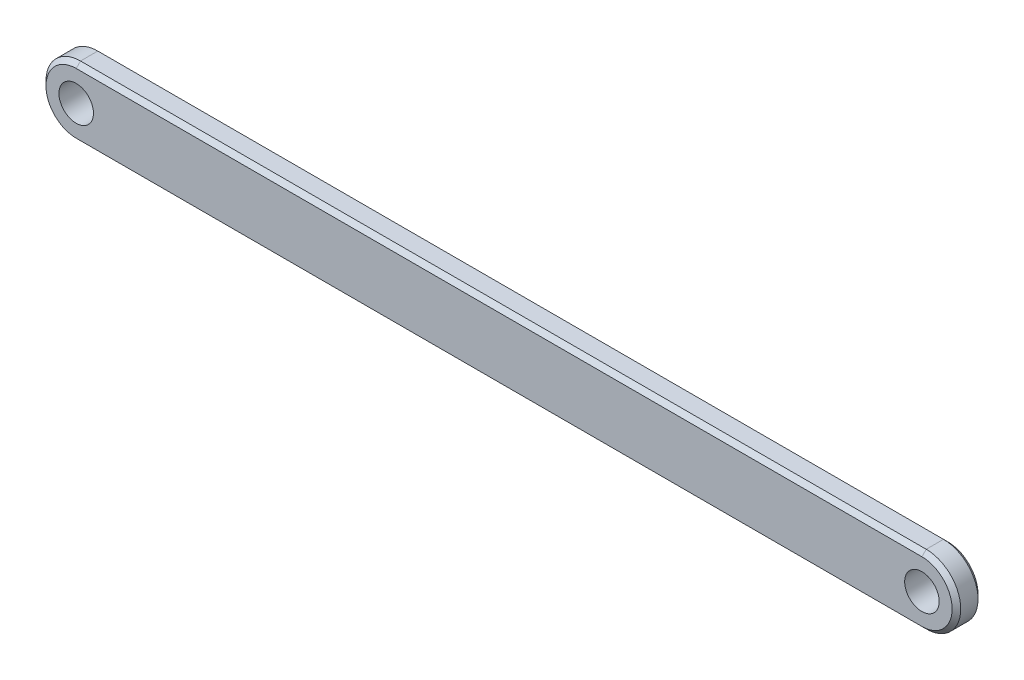
ISO-10303-21;
HEADER;
FILE_DESCRIPTION(('STEP AP214'),'2;1');
FILE_NAME('part.step','',(''),(''),'','','');
FILE_SCHEMA(('AUTOMOTIVE_DESIGN { 1 0 10303 214 1 1 1 1 }'));
ENDSEC;
DATA;
#1=APPLICATION_CONTEXT('core data for automotive mechanical design processes');
#2=APPLICATION_PROTOCOL_DEFINITION('international standard','automotive_design',2000,#1);
#3=PRODUCT_CONTEXT('',#1,'mechanical');
#4=PRODUCT('Part','Part','',(#3));
#5=PRODUCT_RELATED_PRODUCT_CATEGORY('part','',(#4));
#6=PRODUCT_DEFINITION_FORMATION('','',#4);
#7=PRODUCT_DEFINITION_CONTEXT('part definition',#1,'design');
#8=PRODUCT_DEFINITION('design','',#6,#7);
#9=PRODUCT_DEFINITION_SHAPE('','',#8);
#10=(LENGTH_UNIT() NAMED_UNIT(*) SI_UNIT(.MILLI.,.METRE.));
#11=(NAMED_UNIT(*) PLANE_ANGLE_UNIT() SI_UNIT($,.RADIAN.));
#12=(NAMED_UNIT(*) SI_UNIT($,.STERADIAN.) SOLID_ANGLE_UNIT());
#13=UNCERTAINTY_MEASURE_WITH_UNIT(LENGTH_MEASURE(1.E-05),#10,'distance_accuracy_value','');
#14=(GEOMETRIC_REPRESENTATION_CONTEXT(3) GLOBAL_UNCERTAINTY_ASSIGNED_CONTEXT((#13)) GLOBAL_UNIT_ASSIGNED_CONTEXT((#10,
#11,#12)) REPRESENTATION_CONTEXT('',''));
#15=CARTESIAN_POINT('',(0.,0.,0.));
#16=DIRECTION('',(0.,0.,1.));
#17=DIRECTION('',(1.,0.,0.));
#18=AXIS2_PLACEMENT_3D('',#15,#16,#17);
#19=CARTESIAN_POINT('',(-11.0193548387097,0.,3.));
#20=DIRECTION('',(0.,0.,1.));
#21=DIRECTION('',(1.,0.,0.));
#22=AXIS2_PLACEMENT_3D('',#19,#20,#21);
#23=PLANE('',#22);
#24=CARTESIAN_POINT('',(-11.0193548387097,0.,3.));
#25=DIRECTION('',(0.,0.,1.));
#26=DIRECTION('',(1.,0.,0.));
#27=AXIS2_PLACEMENT_3D('',#24,#25,#26);
#28=CIRCLE('',#27,3.5);
#29=CARTESIAN_POINT('',(-11.0193548387097,3.5,3.));
#30=VERTEX_POINT('',#29);
#31=CARTESIAN_POINT('',(-11.0193548387097,-3.5,3.));
#32=VERTEX_POINT('',#31);
#33=EDGE_CURVE('E71',#30,#32,#28,.T.);
#34=ORIENTED_EDGE('',*,*,#33,.T.);
#35=DIRECTION('',(1.,0.,0.));
#36=VECTOR('',#35,1.);
#37=CARTESIAN_POINT('',(86.9806451612903,-3.5,3.));
#38=LINE('',#37,#36);
#39=CARTESIAN_POINT('',(86.9806451612903,-3.5,3.));
#40=VERTEX_POINT('',#39);
#41=EDGE_CURVE('E11',#32,#40,#38,.T.);
#42=ORIENTED_EDGE('',*,*,#41,.T.);
#43=CARTESIAN_POINT('',(86.9806451612903,0.,3.));
#44=DIRECTION('',(0.,0.,1.));
#45=DIRECTION('',(1.,0.,0.));
#46=AXIS2_PLACEMENT_3D('',#43,#44,#45);
#47=CIRCLE('',#46,3.5);
#48=CARTESIAN_POINT('',(86.9806451612903,3.5,3.));
#49=VERTEX_POINT('',#48);
#50=EDGE_CURVE('E56',#40,#49,#47,.T.);
#51=ORIENTED_EDGE('',*,*,#50,.T.);
#52=DIRECTION('',(-1.,0.,0.));
#53=VECTOR('',#52,1.);
#54=CARTESIAN_POINT('',(-11.0193548387097,3.5,3.));
#55=LINE('',#54,#53);
#56=EDGE_CURVE('E181',#49,#30,#55,.T.);
#57=ORIENTED_EDGE('',*,*,#56,.T.);
#58=EDGE_LOOP('',(#34,#42,#51,#57));
#59=FACE_BOUND('',#58,.T.);
#60=CARTESIAN_POINT('',(-11.0193548387097,0.,3.));
#61=DIRECTION('',(0.,0.,1.));
#62=DIRECTION('',(1.,0.,0.));
#63=AXIS2_PLACEMENT_3D('',#60,#61,#62);
#64=CIRCLE('',#63,2.);
#65=CARTESIAN_POINT('',(-9.01935483870968,0.,3.));
#66=VERTEX_POINT('',#65);
#67=EDGE_CURVE('E141',#66,#66,#64,.T.);
#68=ORIENTED_EDGE('',*,*,#67,.F.);
#69=EDGE_LOOP('',(#68));
#70=FACE_BOUND('',#69,.T.);
#71=CARTESIAN_POINT('',(86.9806451612903,0.,3.));
#72=DIRECTION('',(0.,0.,1.));
#73=DIRECTION('',(1.,0.,0.));
#74=AXIS2_PLACEMENT_3D('',#71,#72,#73);
#75=CIRCLE('',#74,2.);
#76=CARTESIAN_POINT('',(88.9806451612903,0.,3.));
#77=VERTEX_POINT('',#76);
#78=EDGE_CURVE('E224',#77,#77,#75,.T.);
#79=ORIENTED_EDGE('',*,*,#78,.F.);
#80=EDGE_LOOP('',(#79));
#81=FACE_BOUND('',#80,.T.);
#82=ADVANCED_FACE('F45',(#59,#70,#81),#23,.T.);
#83=CARTESIAN_POINT('',(-11.0193548387097,0.,0.));
#84=DIRECTION('',(0.,0.,1.));
#85=DIRECTION('',(1.,0.,0.));
#86=AXIS2_PLACEMENT_3D('',#83,#84,#85);
#87=PLANE('',#86);
#88=CARTESIAN_POINT('',(-11.0193548387097,0.,0.));
#89=DIRECTION('',(0.,0.,1.));
#90=DIRECTION('',(1.,0.,0.));
#91=AXIS2_PLACEMENT_3D('',#88,#89,#90);
#92=CIRCLE('',#91,3.5);
#93=CARTESIAN_POINT('',(-11.0193548387097,-3.5,0.));
#94=VERTEX_POINT('',#93);
#95=CARTESIAN_POINT('',(-11.0193548387097,3.5,0.));
#96=VERTEX_POINT('',#95);
#97=EDGE_CURVE('E201',#94,#96,#92,.F.);
#98=ORIENTED_EDGE('',*,*,#97,.T.);
#99=DIRECTION('',(1.,0.,0.));
#100=VECTOR('',#99,1.);
#101=CARTESIAN_POINT('',(-11.0193548387097,3.5,0.));
#102=LINE('',#101,#100);
#103=CARTESIAN_POINT('',(86.9806451612903,3.5,0.));
#104=VERTEX_POINT('',#103);
#105=EDGE_CURVE('E128',#96,#104,#102,.T.);
#106=ORIENTED_EDGE('',*,*,#105,.T.);
#107=CARTESIAN_POINT('',(86.9806451612903,0.,0.));
#108=DIRECTION('',(0.,0.,1.));
#109=DIRECTION('',(1.,0.,0.));
#110=AXIS2_PLACEMENT_3D('',#107,#108,#109);
#111=CIRCLE('',#110,3.5);
#112=CARTESIAN_POINT('',(86.9806451612903,-3.5,0.));
#113=VERTEX_POINT('',#112);
#114=EDGE_CURVE('E204',#104,#113,#111,.F.);
#115=ORIENTED_EDGE('',*,*,#114,.T.);
#116=DIRECTION('',(-1.,0.,0.));
#117=VECTOR('',#116,1.);
#118=CARTESIAN_POINT('',(-11.0193548387097,-3.5,0.));
#119=LINE('',#118,#117);
#120=EDGE_CURVE('E207',#113,#94,#119,.T.);
#121=ORIENTED_EDGE('',*,*,#120,.T.);
#122=EDGE_LOOP('',(#98,#106,#115,#121));
#123=FACE_BOUND('',#122,.T.);
#124=CARTESIAN_POINT('',(-11.0193548387097,0.,0.));
#125=DIRECTION('',(0.,0.,1.));
#126=DIRECTION('',(1.,0.,0.));
#127=AXIS2_PLACEMENT_3D('',#124,#125,#126);
#128=CIRCLE('',#127,2.);
#129=CARTESIAN_POINT('',(-9.01935483870968,0.,0.));
#130=VERTEX_POINT('',#129);
#131=EDGE_CURVE('E220',#130,#130,#128,.T.);
#132=ORIENTED_EDGE('',*,*,#131,.T.);
#133=EDGE_LOOP('',(#132));
#134=FACE_BOUND('',#133,.T.);
#135=CARTESIAN_POINT('',(86.9806451612903,0.,0.));
#136=DIRECTION('',(0.,0.,1.));
#137=DIRECTION('',(1.,0.,0.));
#138=AXIS2_PLACEMENT_3D('',#135,#136,#137);
#139=CIRCLE('',#138,2.);
#140=CARTESIAN_POINT('',(88.9806451612903,0.,0.));
#141=VERTEX_POINT('',#140);
#142=EDGE_CURVE('E170',#141,#141,#139,.T.);
#143=ORIENTED_EDGE('',*,*,#142,.T.);
#144=EDGE_LOOP('',(#143));
#145=FACE_BOUND('',#144,.T.);
#146=ADVANCED_FACE('F239',(#123,#134,#145),#87,.F.);
#147=CARTESIAN_POINT('',(-11.0193548387097,0.,3.));
#148=DIRECTION('',(0.,0.,-1.));
#149=DIRECTION('',(-1.,0.,0.));
#150=AXIS2_PLACEMENT_3D('',#147,#148,#149);
#151=CYLINDRICAL_SURFACE('',#150,4.);
#152=DIRECTION('',(0.,0.,-1.));
#153=VECTOR('',#152,1.);
#154=CARTESIAN_POINT('',(-11.0193548387097,4.,3.));
#155=LINE('',#154,#153);
#156=CARTESIAN_POINT('',(-11.0193548387097,4.,2.5));
#157=VERTEX_POINT('',#156);
#158=CARTESIAN_POINT('',(-11.0193548387097,4.,0.5));
#159=VERTEX_POINT('',#158);
#160=EDGE_CURVE('E120',#157,#159,#155,.T.);
#161=ORIENTED_EDGE('',*,*,#160,.T.);
#162=CARTESIAN_POINT('',(-11.0193548387097,0.,0.5));
#163=DIRECTION('',(0.,0.,1.));
#164=DIRECTION('',(1.,0.,0.));
#165=AXIS2_PLACEMENT_3D('',#162,#163,#164);
#166=CIRCLE('',#165,4.);
#167=CARTESIAN_POINT('',(-11.0193548387097,-4.,0.5));
#168=VERTEX_POINT('',#167);
#169=EDGE_CURVE('E127',#159,#168,#166,.T.);
#170=ORIENTED_EDGE('',*,*,#169,.T.);
#171=DIRECTION('',(0.,0.,-1.));
#172=VECTOR('',#171,1.);
#173=CARTESIAN_POINT('',(-11.0193548387097,-4.,3.));
#174=LINE('',#173,#172);
#175=CARTESIAN_POINT('',(-11.0193548387097,-4.,2.5));
#176=VERTEX_POINT('',#175);
#177=EDGE_CURVE('E122',#176,#168,#174,.T.);
#178=ORIENTED_EDGE('',*,*,#177,.F.);
#179=CARTESIAN_POINT('',(-11.0193548387097,0.,2.5));
#180=DIRECTION('',(0.,0.,1.));
#181=DIRECTION('',(1.,0.,0.));
#182=AXIS2_PLACEMENT_3D('',#179,#180,#181);
#183=CIRCLE('',#182,4.);
#184=EDGE_CURVE('E117',#176,#157,#183,.F.);
#185=ORIENTED_EDGE('',*,*,#184,.T.);
#186=EDGE_LOOP('',(#161,#170,#178,#185));
#187=FACE_BOUND('',#186,.T.);
#188=ADVANCED_FACE('F119',(#187),#151,.T.);
#189=CARTESIAN_POINT('',(-11.0193548387097,-4.,3.));
#190=DIRECTION('',(0.,1.,0.));
#191=DIRECTION('',(-1.,0.,0.));
#192=AXIS2_PLACEMENT_3D('',#189,#190,#191);
#193=PLANE('',#192);
#194=ORIENTED_EDGE('',*,*,#177,.T.);
#195=DIRECTION('',(1.,0.,0.));
#196=VECTOR('',#195,1.);
#197=CARTESIAN_POINT('',(-11.0193548387097,-4.,0.5));
#198=LINE('',#197,#196);
#199=CARTESIAN_POINT('',(86.9806451612903,-4.,0.5));
#200=VERTEX_POINT('',#199);
#201=EDGE_CURVE('E184',#168,#200,#198,.T.);
#202=ORIENTED_EDGE('',*,*,#201,.T.);
#203=DIRECTION('',(0.,0.,-1.));
#204=VECTOR('',#203,1.);
#205=CARTESIAN_POINT('',(86.9806451612903,-4.,3.));
#206=LINE('',#205,#204);
#207=CARTESIAN_POINT('',(86.9806451612903,-4.,2.5));
#208=VERTEX_POINT('',#207);
#209=EDGE_CURVE('E214',#208,#200,#206,.T.);
#210=ORIENTED_EDGE('',*,*,#209,.F.);
#211=DIRECTION('',(-1.,0.,0.));
#212=VECTOR('',#211,1.);
#213=CARTESIAN_POINT('',(-11.0193548387097,-4.,2.5));
#214=LINE('',#213,#212);
#215=EDGE_CURVE('E187',#208,#176,#214,.T.);
#216=ORIENTED_EDGE('',*,*,#215,.T.);
#217=EDGE_LOOP('',(#194,#202,#210,#216));
#218=FACE_BOUND('',#217,.T.);
#219=ADVANCED_FACE('F256',(#218),#193,.F.);
#220=CARTESIAN_POINT('',(86.9806451612903,0.,3.));
#221=DIRECTION('',(0.,0.,-1.));
#222=DIRECTION('',(-1.,0.,0.));
#223=AXIS2_PLACEMENT_3D('',#220,#221,#222);
#224=CYLINDRICAL_SURFACE('',#223,4.);
#225=ORIENTED_EDGE('',*,*,#209,.T.);
#226=CARTESIAN_POINT('',(86.9806451612903,0.,0.5));
#227=DIRECTION('',(0.,0.,1.));
#228=DIRECTION('',(1.,0.,0.));
#229=AXIS2_PLACEMENT_3D('',#226,#227,#228);
#230=CIRCLE('',#229,4.);
#231=CARTESIAN_POINT('',(86.9806451612903,4.,0.5));
#232=VERTEX_POINT('',#231);
#233=EDGE_CURVE('E190',#200,#232,#230,.T.);
#234=ORIENTED_EDGE('',*,*,#233,.T.);
#235=DIRECTION('',(0.,0.,-1.));
#236=VECTOR('',#235,1.);
#237=CARTESIAN_POINT('',(86.9806451612903,4.,3.));
#238=LINE('',#237,#236);
#239=CARTESIAN_POINT('',(86.9806451612903,4.,2.5));
#240=VERTEX_POINT('',#239);
#241=EDGE_CURVE('E140',#240,#232,#238,.T.);
#242=ORIENTED_EDGE('',*,*,#241,.F.);
#243=CARTESIAN_POINT('',(86.9806451612903,0.,2.5));
#244=DIRECTION('',(0.,0.,1.));
#245=DIRECTION('',(1.,0.,0.));
#246=AXIS2_PLACEMENT_3D('',#243,#244,#245);
#247=CIRCLE('',#246,4.);
#248=EDGE_CURVE('E193',#240,#208,#247,.F.);
#249=ORIENTED_EDGE('',*,*,#248,.T.);
#250=EDGE_LOOP('',(#225,#234,#242,#249));
#251=FACE_BOUND('',#250,.T.);
#252=ADVANCED_FACE('F253',(#251),#224,.T.);
#253=CARTESIAN_POINT('',(-11.0193548387097,4.,3.));
#254=DIRECTION('',(0.,-1.,0.));
#255=DIRECTION('',(1.,0.,0.));
#256=AXIS2_PLACEMENT_3D('',#253,#254,#255);
#257=PLANE('',#256);
#258=ORIENTED_EDGE('',*,*,#241,.T.);
#259=DIRECTION('',(-1.,0.,0.));
#260=VECTOR('',#259,1.);
#261=CARTESIAN_POINT('',(-11.0193548387097,4.,0.5));
#262=LINE('',#261,#260);
#263=EDGE_CURVE('E138',#232,#159,#262,.T.);
#264=ORIENTED_EDGE('',*,*,#263,.T.);
#265=ORIENTED_EDGE('',*,*,#160,.F.);
#266=DIRECTION('',(1.,0.,0.));
#267=VECTOR('',#266,1.);
#268=CARTESIAN_POINT('',(86.9806451612903,4.,2.5));
#269=LINE('',#268,#267);
#270=EDGE_CURVE('E135',#157,#240,#269,.T.);
#271=ORIENTED_EDGE('',*,*,#270,.T.);
#272=EDGE_LOOP('',(#258,#264,#265,#271));
#273=FACE_BOUND('',#272,.T.);
#274=ADVANCED_FACE('F134',(#273),#257,.F.);
#275=CARTESIAN_POINT('',(-11.0193548387097,0.,3.));
#276=DIRECTION('',(0.,0.,-1.));
#277=DIRECTION('',(-1.,0.,0.));
#278=AXIS2_PLACEMENT_3D('',#275,#276,#277);
#279=CYLINDRICAL_SURFACE('',#278,2.);
#280=ORIENTED_EDGE('',*,*,#67,.T.);
#281=EDGE_LOOP('',(#280));
#282=FACE_BOUND('',#281,.T.);
#283=ORIENTED_EDGE('',*,*,#131,.F.);
#284=EDGE_LOOP('',(#283));
#285=FACE_BOUND('',#284,.T.);
#286=ADVANCED_FACE('F248',(#282,#285),#279,.F.);
#287=CARTESIAN_POINT('',(86.9806451612903,0.,3.));
#288=DIRECTION('',(0.,0.,-1.));
#289=DIRECTION('',(-1.,0.,0.));
#290=AXIS2_PLACEMENT_3D('',#287,#288,#289);
#291=CYLINDRICAL_SURFACE('',#290,2.);
#292=ORIENTED_EDGE('',*,*,#78,.T.);
#293=EDGE_LOOP('',(#292));
#294=FACE_BOUND('',#293,.T.);
#295=ORIENTED_EDGE('',*,*,#142,.F.);
#296=EDGE_LOOP('',(#295));
#297=FACE_BOUND('',#296,.T.);
#298=ADVANCED_FACE('F235',(#294,#297),#291,.F.);
#299=CARTESIAN_POINT('',(-11.0193548387097,-4.,0.5));
#300=DIRECTION('',(0.,0.707106781186547,0.707106781186547));
#301=DIRECTION('',(1.,0.,0.));
#302=AXIS2_PLACEMENT_3D('',#299,#300,#301);
#303=PLANE('',#302);
#304=DIRECTION('',(0.,-0.707106781186547,0.707106781186547));
#305=VECTOR('',#304,1.);
#306=CARTESIAN_POINT('',(-11.0193548387097,-3.5,0.));
#307=LINE('',#306,#305);
#308=EDGE_CURVE('E171',#94,#168,#307,.T.);
#309=ORIENTED_EDGE('',*,*,#308,.F.);
#310=ORIENTED_EDGE('',*,*,#120,.F.);
#311=DIRECTION('',(0.,0.707106781186547,-0.707106781186547));
#312=VECTOR('',#311,1.);
#313=CARTESIAN_POINT('',(86.9806451612903,-4.,0.5));
#314=LINE('',#313,#312);
#315=EDGE_CURVE('E166',#200,#113,#314,.T.);
#316=ORIENTED_EDGE('',*,*,#315,.F.);
#317=ORIENTED_EDGE('',*,*,#201,.F.);
#318=EDGE_LOOP('',(#309,#310,#316,#317));
#319=FACE_BOUND('',#318,.T.);
#320=ADVANCED_FACE('F284',(#319),#303,.F.);
#321=CARTESIAN_POINT('',(86.9806451612903,0.,0.5));
#322=DIRECTION('',(0.,0.,1.));
#323=DIRECTION('',(1.,0.,0.));
#324=AXIS2_PLACEMENT_3D('',#321,#322,#323);
#325=CONICAL_SURFACE('',#324,4.,0.785398163397448);
#326=ORIENTED_EDGE('',*,*,#315,.T.);
#327=ORIENTED_EDGE('',*,*,#114,.F.);
#328=DIRECTION('',(0.,-0.707106781186547,-0.707106781186547));
#329=VECTOR('',#328,1.);
#330=CARTESIAN_POINT('',(86.9806451612903,4.,0.5));
#331=LINE('',#330,#329);
#332=EDGE_CURVE('E157',#232,#104,#331,.T.);
#333=ORIENTED_EDGE('',*,*,#332,.F.);
#334=ORIENTED_EDGE('',*,*,#233,.F.);
#335=EDGE_LOOP('',(#326,#327,#333,#334));
#336=FACE_BOUND('',#335,.T.);
#337=ADVANCED_FACE('F277',(#336),#325,.T.);
#338=CARTESIAN_POINT('',(-11.0193548387097,0.,0.5));
#339=DIRECTION('',(0.,0.,1.));
#340=DIRECTION('',(1.,0.,0.));
#341=AXIS2_PLACEMENT_3D('',#338,#339,#340);
#342=CONICAL_SURFACE('',#341,4.,0.785398163397448);
#343=ORIENTED_EDGE('',*,*,#308,.T.);
#344=ORIENTED_EDGE('',*,*,#169,.F.);
#345=DIRECTION('',(0.,0.707106781186547,0.707106781186547));
#346=VECTOR('',#345,1.);
#347=CARTESIAN_POINT('',(-11.0193548387097,3.5,0.));
#348=LINE('',#347,#346);
#349=EDGE_CURVE('E154',#96,#159,#348,.T.);
#350=ORIENTED_EDGE('',*,*,#349,.F.);
#351=ORIENTED_EDGE('',*,*,#97,.F.);
#352=EDGE_LOOP('',(#343,#344,#350,#351));
#353=FACE_BOUND('',#352,.T.);
#354=ADVANCED_FACE('F270',(#353),#342,.T.);
#355=CARTESIAN_POINT('',(-11.0193548387097,4.,0.5));
#356=DIRECTION('',(0.,-0.707106781186547,0.707106781186547));
#357=DIRECTION('',(-1.,0.,0.));
#358=AXIS2_PLACEMENT_3D('',#355,#356,#357);
#359=PLANE('',#358);
#360=ORIENTED_EDGE('',*,*,#332,.T.);
#361=ORIENTED_EDGE('',*,*,#105,.F.);
#362=ORIENTED_EDGE('',*,*,#349,.T.);
#363=ORIENTED_EDGE('',*,*,#263,.F.);
#364=EDGE_LOOP('',(#360,#361,#362,#363));
#365=FACE_BOUND('',#364,.T.);
#366=ADVANCED_FACE('F264',(#365),#359,.F.);
#367=CARTESIAN_POINT('',(-11.0193548387097,3.5,3.));
#368=DIRECTION('',(0.,0.707106781186547,0.707106781186547));
#369=DIRECTION('',(1.,0.,0.));
#370=AXIS2_PLACEMENT_3D('',#367,#368,#369);
#371=PLANE('',#370);
#372=DIRECTION('',(0.,-0.707106781186547,0.707106781186547));
#373=VECTOR('',#372,1.);
#374=CARTESIAN_POINT('',(86.9806451612903,4.,2.5));
#375=LINE('',#374,#373);
#376=EDGE_CURVE('E148',#240,#49,#375,.T.);
#377=ORIENTED_EDGE('',*,*,#376,.F.);
#378=ORIENTED_EDGE('',*,*,#270,.F.);
#379=DIRECTION('',(0.,0.707106781186547,-0.707106781186547));
#380=VECTOR('',#379,1.);
#381=CARTESIAN_POINT('',(-11.0193548387097,3.5,3.));
#382=LINE('',#381,#380);
#383=EDGE_CURVE('E50',#30,#157,#382,.T.);
#384=ORIENTED_EDGE('',*,*,#383,.F.);
#385=ORIENTED_EDGE('',*,*,#56,.F.);
#386=EDGE_LOOP('',(#377,#378,#384,#385));
#387=FACE_BOUND('',#386,.T.);
#388=ADVANCED_FACE('F48',(#387),#371,.T.);
#389=CARTESIAN_POINT('',(-11.0193548387097,0.,3.));
#390=DIRECTION('',(0.,0.,-1.));
#391=DIRECTION('',(-1.,0.,0.));
#392=AXIS2_PLACEMENT_3D('',#389,#390,#391);
#393=CONICAL_SURFACE('',#392,3.5,0.785398163397448);
#394=ORIENTED_EDGE('',*,*,#383,.T.);
#395=ORIENTED_EDGE('',*,*,#184,.F.);
#396=DIRECTION('',(0.,-0.707106781186547,-0.707106781186547));
#397=VECTOR('',#396,1.);
#398=CARTESIAN_POINT('',(-11.0193548387097,-3.5,3.));
#399=LINE('',#398,#397);
#400=EDGE_CURVE('E159',#32,#176,#399,.T.);
#401=ORIENTED_EDGE('',*,*,#400,.F.);
#402=ORIENTED_EDGE('',*,*,#33,.F.);
#403=EDGE_LOOP('',(#394,#395,#401,#402));
#404=FACE_BOUND('',#403,.T.);
#405=ADVANCED_FACE('F152',(#404),#393,.T.);
#406=CARTESIAN_POINT('',(86.9806451612903,0.,3.));
#407=DIRECTION('',(0.,0.,-1.));
#408=DIRECTION('',(-1.,0.,0.));
#409=AXIS2_PLACEMENT_3D('',#406,#407,#408);
#410=CONICAL_SURFACE('',#409,3.5,0.785398163397448);
#411=ORIENTED_EDGE('',*,*,#376,.T.);
#412=ORIENTED_EDGE('',*,*,#50,.F.);
#413=DIRECTION('',(0.,0.707106781186547,0.707106781186547));
#414=VECTOR('',#413,1.);
#415=CARTESIAN_POINT('',(86.9806451612903,-4.,2.5));
#416=LINE('',#415,#414);
#417=EDGE_CURVE('E64',#208,#40,#416,.T.);
#418=ORIENTED_EDGE('',*,*,#417,.F.);
#419=ORIENTED_EDGE('',*,*,#248,.F.);
#420=EDGE_LOOP('',(#411,#412,#418,#419));
#421=FACE_BOUND('',#420,.T.);
#422=ADVANCED_FACE('F298',(#421),#410,.T.);
#423=CARTESIAN_POINT('',(-11.0193548387097,-3.5,3.));
#424=DIRECTION('',(0.,-0.707106781186547,0.707106781186547));
#425=DIRECTION('',(-1.,0.,0.));
#426=AXIS2_PLACEMENT_3D('',#423,#424,#425);
#427=PLANE('',#426);
#428=ORIENTED_EDGE('',*,*,#400,.T.);
#429=ORIENTED_EDGE('',*,*,#215,.F.);
#430=ORIENTED_EDGE('',*,*,#417,.T.);
#431=ORIENTED_EDGE('',*,*,#41,.F.);
#432=EDGE_LOOP('',(#428,#429,#430,#431));
#433=FACE_BOUND('',#432,.T.);
#434=ADVANCED_FACE('F292',(#433),#427,.T.);
#435=CLOSED_SHELL('',(#82,#146,#188,#219,#252,#274,#286,#298,#320,#337,#354,#366,#388,#405,#422,#434));
#436=MANIFOLD_SOLID_BREP('B2',#435);
#437=ADVANCED_BREP_SHAPE_REPRESENTATION('',(#18,#436),#14);
#438=SHAPE_DEFINITION_REPRESENTATION(#9,#437);
ENDSEC;
END-ISO-10303-21;
